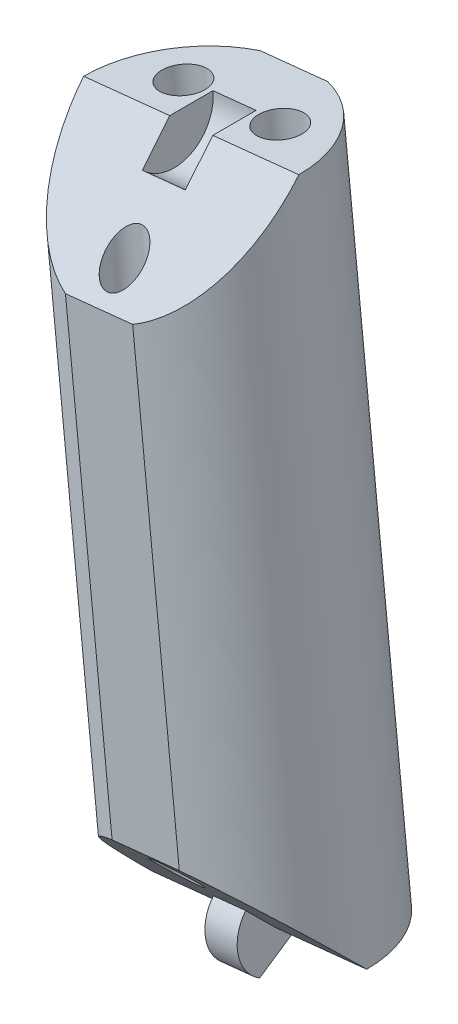
ISO-10303-21;
HEADER;
FILE_DESCRIPTION(('STEP AP214'),'2;1');
FILE_NAME('part.step','',(''),(''),'','','');
FILE_SCHEMA(('AUTOMOTIVE_DESIGN { 1 0 10303 214 1 1 1 1 }'));
ENDSEC;
DATA;
#1=APPLICATION_CONTEXT('core data for automotive mechanical design processes');
#2=APPLICATION_PROTOCOL_DEFINITION('international standard','automotive_design',2000,#1);
#3=PRODUCT_CONTEXT('',#1,'mechanical');
#4=PRODUCT('Part','Part','',(#3));
#5=PRODUCT_RELATED_PRODUCT_CATEGORY('part','',(#4));
#6=PRODUCT_DEFINITION_FORMATION('','',#4);
#7=PRODUCT_DEFINITION_CONTEXT('part definition',#1,'design');
#8=PRODUCT_DEFINITION('design','',#6,#7);
#9=PRODUCT_DEFINITION_SHAPE('','',#8);
#10=(LENGTH_UNIT() NAMED_UNIT(*) SI_UNIT(.MILLI.,.METRE.));
#11=(NAMED_UNIT(*) PLANE_ANGLE_UNIT() SI_UNIT($,.RADIAN.));
#12=(NAMED_UNIT(*) SI_UNIT($,.STERADIAN.) SOLID_ANGLE_UNIT());
#13=UNCERTAINTY_MEASURE_WITH_UNIT(LENGTH_MEASURE(1.E-05),#10,'distance_accuracy_value','');
#14=(GEOMETRIC_REPRESENTATION_CONTEXT(3) GLOBAL_UNCERTAINTY_ASSIGNED_CONTEXT((#13)) GLOBAL_UNIT_ASSIGNED_CONTEXT((#10,
#11,#12)) REPRESENTATION_CONTEXT('',''));
#15=CARTESIAN_POINT('',(0.,0.,0.));
#16=DIRECTION('',(0.,0.,1.));
#17=DIRECTION('',(1.,0.,0.));
#18=AXIS2_PLACEMENT_3D('',#15,#16,#17);
#19=CARTESIAN_POINT('',(-4.95217016442193,148.881060651689,0.));
#20=DIRECTION('',(-0.103150523023817,0.994665757729657,0.));
#21=DIRECTION('',(-0.994665757729657,-0.103150523023817,0.));
#22=AXIS2_PLACEMENT_3D('',#19,#20,#21);
#23=CYLINDRICAL_SURFACE('',#22,8.);
#24=CARTESIAN_POINT('',(-4.95217016442193,148.881060651689,0.));
#25=DIRECTION('',(0.103150523023817,-0.994665757729657,0.));
#26=DIRECTION('',(0.994665757729657,0.103150523023817,0.));
#27=AXIS2_PLACEMENT_3D('',#24,#25,#26);
#28=CIRCLE('',#27,8.);
#29=CARTESIAN_POINT('',(-2.46749589798306,149.138730575616,-7.6));
#30=VERTEX_POINT('',#29);
#31=CARTESIAN_POINT('',(3.00515589741533,149.70626483588,0.));
#32=VERTEX_POINT('',#31);
#33=EDGE_CURVE('E156',#30,#32,#28,.T.);
#34=ORIENTED_EDGE('',*,*,#33,.F.);
#35=DIRECTION('',(-0.103150523023817,0.994665757729657,0.));
#36=VECTOR('',#35,1.);
#37=CARTESIAN_POINT('',(-2.46749589798307,149.138730575616,-7.6));
#38=LINE('',#37,#36);
#39=CARTESIAN_POINT('',(-7.48403157112503,197.512467423771,-7.6));
#40=VERTEX_POINT('',#39);
#41=EDGE_CURVE('E11',#30,#40,#38,.T.);
#42=ORIENTED_EDGE('',*,*,#41,.T.);
#43=CARTESIAN_POINT('',(-9.9687058375639,197.254797499844,0.));
#44=DIRECTION('',(0.103150523023817,-0.994665757729657,0.));
#45=DIRECTION('',(0.994665757729657,0.103150523023817,0.));
#46=AXIS2_PLACEMENT_3D('',#43,#44,#45);
#47=CIRCLE('',#46,8.);
#48=CARTESIAN_POINT('',(-2.01137977572664,198.080001684034,0.));
#49=VERTEX_POINT('',#48);
#50=EDGE_CURVE('E148',#40,#49,#47,.T.);
#51=ORIENTED_EDGE('',*,*,#50,.T.);
#52=CARTESIAN_POINT('',(-9.9687058375639,197.254797499844,0.));
#53=DIRECTION('',(0.0729384343130804,-0.703334902304701,-0.707106781186543));
#54=DIRECTION('',(-0.0729384343130795,0.703334902304692,-0.707106781186552));
#55=AXIS2_PLACEMENT_3D('',#52,#53,#54);
#56=ELLIPSE('',#55,11.3137084989847,8.);
#57=CARTESIAN_POINT('',(-6.70008759614404,189.953007665026,7.6));
#58=VERTEX_POINT('',#57);
#59=EDGE_CURVE('E202',#49,#58,#56,.T.);
#60=ORIENTED_EDGE('',*,*,#59,.T.);
#61=DIRECTION('',(-0.103150523023817,0.994665757729657,0.));
#62=VECTOR('',#61,1.);
#63=CARTESIAN_POINT('',(-2.46749589798307,149.138730575616,7.6));
#64=LINE('',#63,#62);
#65=CARTESIAN_POINT('',(-3.25143987296407,156.698190334362,7.6));
#66=VERTEX_POINT('',#65);
#67=EDGE_CURVE('E174',#58,#66,#64,.F.);
#68=ORIENTED_EDGE('',*,*,#67,.T.);
#69=CARTESIAN_POINT('',(-4.95217016442193,148.881060651689,0.));
#70=DIRECTION('',(-0.0729384343130803,0.703334902304699,-0.707106781186544));
#71=DIRECTION('',(-0.0729384343130797,0.703334902304693,0.707106781186551));
#72=AXIS2_PLACEMENT_3D('',#69,#70,#71);
#73=ELLIPSE('',#72,11.3137084989847,8.);
#74=EDGE_CURVE('E207',#66,#32,#73,.T.);
#75=ORIENTED_EDGE('',*,*,#74,.T.);
#76=EDGE_LOOP('',(#34,#42,#51,#60,#68,#75));
#77=FACE_BOUND('',#76,.T.);
#78=ADVANCED_FACE('F39',(#77),#23,.T.);
#79=CARTESIAN_POINT('',(-9.9687058375639,197.254797499844,0.));
#80=DIRECTION('',(0.103150523023817,-0.994665757729657,0.));
#81=DIRECTION('',(0.994665757729657,0.103150523023817,0.));
#82=AXIS2_PLACEMENT_3D('',#79,#80,#81);
#83=PLANE('',#82);
#84=CARTESIAN_POINT('',(-6.38790910973713,197.62613938273,-3.));
#85=DIRECTION('',(0.103150523023817,-0.994665757729657,0.));
#86=DIRECTION('',(0.994665757729657,0.103150523023817,0.));
#87=AXIS2_PLACEMENT_3D('',#84,#85,#86);
#88=CIRCLE('',#87,1.6);
#89=CARTESIAN_POINT('',(-4.79644389736968,197.791180219568,-3.));
#90=VERTEX_POINT('',#89);
#91=EDGE_CURVE('E189',#90,#90,#88,.T.);
#92=ORIENTED_EDGE('',*,*,#91,.T.);
#93=EDGE_LOOP('',(#92));
#94=FACE_BOUND('',#93,.T.);
#95=CARTESIAN_POINT('',(-13.5495025653907,196.883455616958,-3.));
#96=DIRECTION('',(0.103150523023817,-0.994665757729657,0.));
#97=DIRECTION('',(0.994665757729657,0.103150523023817,0.));
#98=AXIS2_PLACEMENT_3D('',#95,#96,#97);
#99=CIRCLE('',#98,1.6);
#100=CARTESIAN_POINT('',(-11.9580373530232,197.048496453796,-3.));
#101=VERTEX_POINT('',#100);
#102=EDGE_CURVE('E184',#101,#101,#99,.T.);
#103=ORIENTED_EDGE('',*,*,#102,.T.);
#104=EDGE_LOOP('',(#103));
#105=FACE_BOUND('',#104,.T.);
#106=ORIENTED_EDGE('',*,*,#50,.F.);
#107=DIRECTION('',(0.994665757729657,0.103150523023816,0.));
#108=VECTOR('',#107,1.);
#109=CARTESIAN_POINT('',(-12.4533801040028,196.997127575917,-7.6));
#110=LINE('',#109,#108);
#111=CARTESIAN_POINT('',(-12.4533801040028,196.997127575917,-7.6));
#112=VERTEX_POINT('',#111);
#113=EDGE_CURVE('E134',#112,#40,#110,.T.);
#114=ORIENTED_EDGE('',*,*,#113,.F.);
#115=CARTESIAN_POINT('',(-17.9260318994012,196.429593315653,0.));
#116=VERTEX_POINT('',#115);
#117=EDGE_CURVE('E146',#116,#112,#47,.T.);
#118=ORIENTED_EDGE('',*,*,#117,.F.);
#119=DIRECTION('',(0.994665757729657,0.103150523023817,0.));
#120=VECTOR('',#119,1.);
#121=CARTESIAN_POINT('',(-9.9687058375639,197.254797499844,0.));
#122=LINE('',#121,#120);
#123=CARTESIAN_POINT('',(-11.5601710499314,197.089756663006,0.));
#124=VERTEX_POINT('',#123);
#125=EDGE_CURVE('E165',#116,#124,#122,.T.);
#126=ORIENTED_EDGE('',*,*,#125,.T.);
#127=DIRECTION('',(0.,0.,-1.));
#128=VECTOR('',#127,1.);
#129=CARTESIAN_POINT('',(-11.5601710499314,197.089756663006,0.));
#130=LINE('',#129,#128);
#131=CARTESIAN_POINT('',(-11.5601710499314,197.089756663006,-3.2));
#132=VERTEX_POINT('',#131);
#133=EDGE_CURVE('E256',#124,#132,#130,.T.);
#134=ORIENTED_EDGE('',*,*,#133,.T.);
#135=DIRECTION('',(-0.994665757729657,-0.103150523023817,0.));
#136=VECTOR('',#135,1.);
#137=CARTESIAN_POINT('',(-8.37724062519646,197.419838336682,-3.2));
#138=LINE('',#137,#136);
#139=CARTESIAN_POINT('',(-8.37724062519646,197.419838336682,-3.2));
#140=VERTEX_POINT('',#139);
#141=EDGE_CURVE('E269',#140,#132,#138,.T.);
#142=ORIENTED_EDGE('',*,*,#141,.F.);
#143=DIRECTION('',(0.,0.,-1.));
#144=VECTOR('',#143,1.);
#145=CARTESIAN_POINT('',(-8.37724062519647,197.419838336682,0.));
#146=LINE('',#145,#144);
#147=CARTESIAN_POINT('',(-8.37724062519647,197.419838336682,0.));
#148=VERTEX_POINT('',#147);
#149=EDGE_CURVE('E257',#148,#140,#146,.T.);
#150=ORIENTED_EDGE('',*,*,#149,.F.);
#151=EDGE_CURVE('E169',#148,#49,#122,.T.);
#152=ORIENTED_EDGE('',*,*,#151,.T.);
#153=EDGE_LOOP('',(#106,#114,#118,#126,#134,#142,#150,#152));
#154=FACE_BOUND('',#153,.T.);
#155=ADVANCED_FACE('F144',(#94,#105,#154),#83,.F.);
#156=CARTESIAN_POINT('',(2.95177980534998,198.594699714665,0.));
#157=DIRECTION('',(0.0729384343130804,-0.703334902304701,-0.707106781186543));
#158=DIRECTION('',(0.,0.708995228875744,-0.705213276556412));
#159=AXIS2_PLACEMENT_3D('',#156,#157,#158);
#160=PLANE('',#159);
#161=CARTESIAN_POINT('',(-9.40137796093292,191.784135832331,5.5));
#162=DIRECTION('',(0.0729384343130804,-0.703334902304701,-0.707106781186543));
#163=DIRECTION('',(-0.0729384343130795,0.703334902304692,-0.707106781186552));
#164=AXIS2_PLACEMENT_3D('',#161,#162,#163);
#165=ELLIPSE('',#164,1.97989898732232,1.4);
#166=CARTESIAN_POINT('',(-9.54578869316626,193.176667893152,4.1));
#167=VERTEX_POINT('',#166);
#168=EDGE_CURVE('E179',#167,#167,#165,.T.);
#169=ORIENTED_EDGE('',*,*,#168,.T.);
#170=EDGE_LOOP('',(#169));
#171=FACE_BOUND('',#170,.T.);
#172=CARTESIAN_POINT('',(-11.6694361290218,189.437667817172,7.6));
#173=VERTEX_POINT('',#172);
#174=EDGE_CURVE('E153',#173,#116,#56,.T.);
#175=ORIENTED_EDGE('',*,*,#174,.F.);
#176=DIRECTION('',(0.994665757729657,0.103150523023817,0.));
#177=VECTOR('',#176,1.);
#178=CARTESIAN_POINT('',(3.73572378033098,191.035239955919,7.6));
#179=LINE('',#178,#177);
#180=EDGE_CURVE('E198',#173,#58,#179,.T.);
#181=ORIENTED_EDGE('',*,*,#180,.T.);
#182=ORIENTED_EDGE('',*,*,#59,.F.);
#183=ORIENTED_EDGE('',*,*,#151,.F.);
#184=DIRECTION('',(-0.0729384343130776,0.703334902304677,-0.707106781186567));
#185=VECTOR('',#184,1.);
#186=CARTESIAN_POINT('',(-8.14383763539462,195.169166649307,2.26274169979702));
#187=LINE('',#186,#185);
#188=CARTESIAN_POINT('',(-8.14383763539462,195.169166649307,2.26274169979702));
#189=VERTEX_POINT('',#188);
#190=EDGE_CURVE('E266',#189,#148,#187,.T.);
#191=ORIENTED_EDGE('',*,*,#190,.F.);
#192=DIRECTION('',(-0.994665757729657,-0.103150523023817,0.));
#193=VECTOR('',#192,1.);
#194=CARTESIAN_POINT('',(-8.14383763539462,195.169166649307,2.26274169979702));
#195=LINE('',#194,#193);
#196=CARTESIAN_POINT('',(-11.3267680601295,194.839084975631,2.26274169979702));
#197=VERTEX_POINT('',#196);
#198=EDGE_CURVE('E278',#189,#197,#195,.T.);
#199=ORIENTED_EDGE('',*,*,#198,.T.);
#200=DIRECTION('',(-0.0729384343130776,0.703334902304677,-0.707106781186567));
#201=VECTOR('',#200,1.);
#202=CARTESIAN_POINT('',(-11.3267680601295,194.839084975631,2.26274169979702));
#203=LINE('',#202,#201);
#204=EDGE_CURVE('E262',#197,#124,#203,.T.);
#205=ORIENTED_EDGE('',*,*,#204,.T.);
#206=ORIENTED_EDGE('',*,*,#125,.F.);
#207=EDGE_LOOP('',(#175,#181,#182,#183,#191,#199,#205,#206));
#208=FACE_BOUND('',#207,.T.);
#209=ADVANCED_FACE('F196',(#171,#208),#160,.F.);
#210=CARTESIAN_POINT('',(-4.95217016442193,148.881060651689,0.));
#211=DIRECTION('',(0.103150523023817,-0.994665757729657,0.));
#212=DIRECTION('',(0.994665757729657,0.103150523023817,0.));
#213=AXIS2_PLACEMENT_3D('',#210,#211,#212);
#214=PLANE('',#213);
#215=DIRECTION('',(-0.994665757729657,-0.103150523023817,0.));
#216=VECTOR('',#215,1.);
#217=CARTESIAN_POINT('',(-4.95217016442193,148.881060651689,-7.6));
#218=LINE('',#217,#216);
#219=CARTESIAN_POINT('',(-7.43684443086079,148.623390727762,-7.6));
#220=VERTEX_POINT('',#219);
#221=EDGE_CURVE('E55',#30,#220,#218,.T.);
#222=ORIENTED_EDGE('',*,*,#221,.F.);
#223=ORIENTED_EDGE('',*,*,#33,.T.);
#224=DIRECTION('',(0.994665757729657,0.103150523023817,0.));
#225=VECTOR('',#224,1.);
#226=CARTESIAN_POINT('',(-4.95217016442193,148.881060651689,0.));
#227=LINE('',#226,#225);
#228=CARTESIAN_POINT('',(-3.75857125514635,149.004841279318,0.));
#229=VERTEX_POINT('',#228);
#230=EDGE_CURVE('E168',#229,#32,#227,.T.);
#231=ORIENTED_EDGE('',*,*,#230,.F.);
#232=DIRECTION('',(0.,0.,-1.));
#233=VECTOR('',#232,1.);
#234=CARTESIAN_POINT('',(-3.75857125514636,149.004841279318,0.));
#235=LINE('',#234,#233);
#236=CARTESIAN_POINT('',(-3.75857125514636,149.004841279318,-2.8));
#237=VERTEX_POINT('',#236);
#238=EDGE_CURVE('E282',#229,#237,#235,.T.);
#239=ORIENTED_EDGE('',*,*,#238,.T.);
#240=DIRECTION('',(0.994665757729657,0.103150523023817,0.));
#241=VECTOR('',#240,1.);
#242=CARTESIAN_POINT('',(-6.14576907369753,148.757280024061,-2.8));
#243=LINE('',#242,#241);
#244=CARTESIAN_POINT('',(-6.14576907369753,148.757280024061,-2.8));
#245=VERTEX_POINT('',#244);
#246=EDGE_CURVE('E203',#245,#237,#243,.T.);
#247=ORIENTED_EDGE('',*,*,#246,.F.);
#248=DIRECTION('',(0.,0.,-1.));
#249=VECTOR('',#248,1.);
#250=CARTESIAN_POINT('',(-6.14576907369753,148.757280024061,0.));
#251=LINE('',#250,#249);
#252=CARTESIAN_POINT('',(-6.14576907369753,148.757280024061,0.));
#253=VERTEX_POINT('',#252);
#254=EDGE_CURVE('E237',#253,#245,#251,.T.);
#255=ORIENTED_EDGE('',*,*,#254,.F.);
#256=CARTESIAN_POINT('',(-12.9094962262592,148.055856467499,0.));
#257=VERTEX_POINT('',#256);
#258=EDGE_CURVE('E170',#257,#253,#227,.T.);
#259=ORIENTED_EDGE('',*,*,#258,.F.);
#260=EDGE_CURVE('E160',#257,#220,#28,.T.);
#261=ORIENTED_EDGE('',*,*,#260,.T.);
#262=EDGE_LOOP('',(#222,#223,#231,#239,#247,#255,#259,#261));
#263=FACE_BOUND('',#262,.T.);
#264=CARTESIAN_POINT('',(-1.37137343659516,149.252402534575,-3.));
#265=DIRECTION('',(0.103150523023817,-0.994665757729657,0.));
#266=DIRECTION('',(0.994665757729657,0.103150523023817,0.));
#267=AXIS2_PLACEMENT_3D('',#264,#265,#266);
#268=CIRCLE('',#267,1.6);
#269=CARTESIAN_POINT('',(0.220091775772289,149.417443371413,-3.));
#270=VERTEX_POINT('',#269);
#271=EDGE_CURVE('E185',#270,#270,#268,.T.);
#272=ORIENTED_EDGE('',*,*,#271,.F.);
#273=EDGE_LOOP('',(#272));
#274=FACE_BOUND('',#273,.T.);
#275=CARTESIAN_POINT('',(-8.53296689224869,148.509718768804,-3.));
#276=DIRECTION('',(0.103150523023817,-0.994665757729657,0.));
#277=DIRECTION('',(0.994665757729657,0.103150523023817,0.));
#278=AXIS2_PLACEMENT_3D('',#275,#276,#277);
#279=CIRCLE('',#278,1.6);
#280=CARTESIAN_POINT('',(-6.94150167988124,148.674759605642,-3.));
#281=VERTEX_POINT('',#280);
#282=EDGE_CURVE('E180',#281,#281,#279,.T.);
#283=ORIENTED_EDGE('',*,*,#282,.F.);
#284=EDGE_LOOP('',(#283));
#285=FACE_BOUND('',#284,.T.);
#286=ADVANCED_FACE('F232',(#263,#274,#285),#214,.T.);
#287=CARTESIAN_POINT('',(7.96831547849195,150.22096286651,0.));
#288=DIRECTION('',(-0.0729384343130803,0.703334902304699,-0.707106781186544));
#289=DIRECTION('',(0.,0.708995228875745,0.705213276556411));
#290=AXIS2_PLACEMENT_3D('',#287,#288,#289);
#291=PLANE('',#290);
#292=CARTESIAN_POINT('',(-5.51949804105292,154.351722319203,5.5));
#293=DIRECTION('',(-0.0729384343130803,0.703334902304699,-0.707106781186544));
#294=DIRECTION('',(-0.0729384343130797,0.703334902304693,0.707106781186551));
#295=AXIS2_PLACEMENT_3D('',#292,#293,#294);
#296=ELLIPSE('',#295,1.97989898732232,1.4);
#297=CARTESIAN_POINT('',(-5.66390877328626,155.744254380024,6.9));
#298=VERTEX_POINT('',#297);
#299=EDGE_CURVE('E175',#298,#298,#296,.T.);
#300=ORIENTED_EDGE('',*,*,#299,.T.);
#301=EDGE_LOOP('',(#300));
#302=FACE_BOUND('',#301,.T.);
#303=ORIENTED_EDGE('',*,*,#74,.F.);
#304=DIRECTION('',(-0.994665757729657,-0.103150523023817,0.));
#305=VECTOR('',#304,1.);
#306=CARTESIAN_POINT('',(7.18437150351095,157.780422625256,7.6));
#307=LINE('',#306,#305);
#308=CARTESIAN_POINT('',(-8.2207884058418,156.182850486508,7.6));
#309=VERTEX_POINT('',#308);
#310=EDGE_CURVE('E63',#66,#309,#307,.T.);
#311=ORIENTED_EDGE('',*,*,#310,.T.);
#312=EDGE_CURVE('E162',#257,#309,#73,.T.);
#313=ORIENTED_EDGE('',*,*,#312,.F.);
#314=ORIENTED_EDGE('',*,*,#258,.T.);
#315=DIRECTION('',(0.0729384343130803,-0.703334902304701,-0.707106781186543));
#316=VECTOR('',#315,1.);
#317=CARTESIAN_POINT('',(-6.34999668977416,150.726617750514,1.97989898732232));
#318=LINE('',#317,#316);
#319=CARTESIAN_POINT('',(-6.34999668977416,150.726617750514,1.97989898732232));
#320=VERTEX_POINT('',#319);
#321=EDGE_CURVE('E239',#320,#253,#318,.T.);
#322=ORIENTED_EDGE('',*,*,#321,.F.);
#323=DIRECTION('',(0.994665757729657,0.103150523023817,0.));
#324=VECTOR('',#323,1.);
#325=CARTESIAN_POINT('',(-6.34999668977416,150.726617750514,1.97989898732232));
#326=LINE('',#325,#324);
#327=CARTESIAN_POINT('',(-3.96279887122298,150.974179005771,1.97989898732232));
#328=VERTEX_POINT('',#327);
#329=EDGE_CURVE('E295',#320,#328,#326,.T.);
#330=ORIENTED_EDGE('',*,*,#329,.T.);
#331=DIRECTION('',(0.0729384343130803,-0.703334902304701,-0.707106781186543));
#332=VECTOR('',#331,1.);
#333=CARTESIAN_POINT('',(-3.96279887122298,150.974179005771,1.97989898732232));
#334=LINE('',#333,#332);
#335=EDGE_CURVE('E225',#328,#229,#334,.T.);
#336=ORIENTED_EDGE('',*,*,#335,.T.);
#337=ORIENTED_EDGE('',*,*,#230,.T.);
#338=EDGE_LOOP('',(#303,#311,#313,#314,#322,#330,#336,#337));
#339=FACE_BOUND('',#338,.T.);
#340=ADVANCED_FACE('F222',(#302,#339),#291,.F.);
#341=ORIENTED_EDGE('',*,*,#117,.T.);
#342=DIRECTION('',(-0.103150523023817,0.994665757729657,0.));
#343=VECTOR('',#342,1.);
#344=CARTESIAN_POINT('',(-7.43684443086079,148.623390727762,-7.6));
#345=LINE('',#344,#343);
#346=EDGE_CURVE('E48',#112,#220,#345,.F.);
#347=ORIENTED_EDGE('',*,*,#346,.T.);
#348=ORIENTED_EDGE('',*,*,#260,.F.);
#349=ORIENTED_EDGE('',*,*,#312,.T.);
#350=DIRECTION('',(-0.103150523023817,0.994665757729657,0.));
#351=VECTOR('',#350,1.);
#352=CARTESIAN_POINT('',(-7.43684443086079,148.623390727762,7.6));
#353=LINE('',#352,#351);
#354=EDGE_CURVE('E140',#309,#173,#353,.T.);
#355=ORIENTED_EDGE('',*,*,#354,.T.);
#356=ORIENTED_EDGE('',*,*,#174,.T.);
#357=EDGE_LOOP('',(#341,#347,#348,#349,#355,#356));
#358=FACE_BOUND('',#357,.T.);
#359=ADVANCED_FACE('F41',(#358),#23,.T.);
#360=CARTESIAN_POINT('',(-6.14576907369753,148.757280024061,-2.8));
#361=DIRECTION('',(-0.0893309733522772,0.861405814468384,0.499999999999995));
#362=DIRECTION('',(0.,-0.502007025803858,0.864863541862856));
#363=AXIS2_PLACEMENT_3D('',#360,#361,#362);
#364=PLANE('',#363);
#365=DIRECTION('',(0.0515752615119079,-0.497332878864824,0.866025403784442));
#366=VECTOR('',#365,1.);
#367=CARTESIAN_POINT('',(-3.75857125514636,149.004841279318,-2.8));
#368=LINE('',#367,#366);
#369=CARTESIAN_POINT('',(-3.50844452975998,146.592904998807,1.40000000000003));
#370=VERTEX_POINT('',#369);
#371=EDGE_CURVE('E298',#237,#370,#368,.T.);
#372=ORIENTED_EDGE('',*,*,#371,.T.);
#373=DIRECTION('',(0.994665757729657,0.103150523023817,0.));
#374=VECTOR('',#373,1.);
#375=CARTESIAN_POINT('',(-5.89564234831116,146.345343743549,1.40000000000003));
#376=LINE('',#375,#374);
#377=CARTESIAN_POINT('',(-5.89564234831116,146.345343743549,1.40000000000003));
#378=VERTEX_POINT('',#377);
#379=EDGE_CURVE('E209',#378,#370,#376,.T.);
#380=ORIENTED_EDGE('',*,*,#379,.F.);
#381=DIRECTION('',(0.0515752615119079,-0.497332878864824,0.866025403784442));
#382=VECTOR('',#381,1.);
#383=CARTESIAN_POINT('',(-6.14576907369753,148.757280024061,-2.8));
#384=LINE('',#383,#382);
#385=EDGE_CURVE('E287',#245,#378,#384,.T.);
#386=ORIENTED_EDGE('',*,*,#385,.F.);
#387=ORIENTED_EDGE('',*,*,#246,.T.);
#388=EDGE_LOOP('',(#372,#380,#386,#387));
#389=FACE_BOUND('',#388,.T.);
#390=ADVANCED_FACE('F318',(#389),#364,.F.);
#391=CARTESIAN_POINT('',(-6.14576907369753,148.757280024061,0.));
#392=DIRECTION('',(0.994665757729657,0.103150523023817,0.));
#393=DIRECTION('',(-0.103150523023817,0.994665757729657,0.));
#394=AXIS2_PLACEMENT_3D('',#391,#392,#393);
#395=CYLINDRICAL_SURFACE('',#394,2.8);
#396=CARTESIAN_POINT('',(-3.75857125514636,149.004841279318,0.));
#397=DIRECTION('',(-0.994665757729657,-0.103150523023817,0.));
#398=DIRECTION('',(-0.103150523023817,0.994665757729657,0.));
#399=AXIS2_PLACEMENT_3D('',#396,#397,#398);
#400=CIRCLE('',#399,2.8);
#401=EDGE_CURVE('E301',#370,#328,#400,.T.);
#402=ORIENTED_EDGE('',*,*,#401,.T.);
#403=ORIENTED_EDGE('',*,*,#329,.F.);
#404=CARTESIAN_POINT('',(-6.14576907369753,148.757280024061,0.));
#405=DIRECTION('',(-0.994665757729657,-0.103150523023817,0.));
#406=DIRECTION('',(-0.103150523023817,0.994665757729657,0.));
#407=AXIS2_PLACEMENT_3D('',#404,#405,#406);
#408=CIRCLE('',#407,2.8);
#409=EDGE_CURVE('E290',#378,#320,#408,.T.);
#410=ORIENTED_EDGE('',*,*,#409,.F.);
#411=ORIENTED_EDGE('',*,*,#379,.T.);
#412=EDGE_LOOP('',(#402,#403,#410,#411));
#413=FACE_BOUND('',#412,.T.);
#414=ADVANCED_FACE('F313',(#413),#395,.T.);
#415=CARTESIAN_POINT('',(-6.14576907369753,148.757280024061,0.));
#416=DIRECTION('',(0.994665757729657,0.103150523023817,0.));
#417=DIRECTION('',(-0.103150523023817,0.994665757729657,0.));
#418=AXIS2_PLACEMENT_3D('',#415,#416,#417);
#419=PLANE('',#418);
#420=ORIENTED_EDGE('',*,*,#254,.T.);
#421=ORIENTED_EDGE('',*,*,#385,.T.);
#422=ORIENTED_EDGE('',*,*,#409,.T.);
#423=ORIENTED_EDGE('',*,*,#321,.T.);
#424=EDGE_LOOP('',(#420,#421,#422,#423));
#425=FACE_BOUND('',#424,.T.);
#426=ADVANCED_FACE('F320',(#425),#419,.F.);
#427=CARTESIAN_POINT('',(-3.75857125514636,149.004841279318,0.));
#428=DIRECTION('',(0.994665757729657,0.103150523023817,0.));
#429=DIRECTION('',(-0.103150523023817,0.994665757729657,0.));
#430=AXIS2_PLACEMENT_3D('',#427,#428,#429);
#431=PLANE('',#430);
#432=ORIENTED_EDGE('',*,*,#238,.F.);
#433=ORIENTED_EDGE('',*,*,#335,.F.);
#434=ORIENTED_EDGE('',*,*,#401,.F.);
#435=ORIENTED_EDGE('',*,*,#371,.F.);
#436=EDGE_LOOP('',(#432,#433,#434,#435));
#437=FACE_BOUND('',#436,.T.);
#438=ADVANCED_FACE('F317',(#437),#431,.T.);
#439=CARTESIAN_POINT('',(-8.37724062519647,197.419838336682,0.));
#440=DIRECTION('',(-0.994665757729657,-0.103150523023817,0.));
#441=DIRECTION('',(0.103150523023817,-0.994665757729657,0.));
#442=AXIS2_PLACEMENT_3D('',#439,#440,#441);
#443=CYLINDRICAL_SURFACE('',#442,3.2);
#444=CARTESIAN_POINT('',(-11.5601710499314,197.089756663006,0.));
#445=DIRECTION('',(-0.994665757729657,-0.103150523023817,0.));
#446=DIRECTION('',(0.103150523023817,-0.994665757729657,0.));
#447=AXIS2_PLACEMENT_3D('',#444,#445,#446);
#448=CIRCLE('',#447,3.2);
#449=EDGE_CURVE('E273',#132,#197,#448,.T.);
#450=ORIENTED_EDGE('',*,*,#449,.T.);
#451=ORIENTED_EDGE('',*,*,#198,.F.);
#452=CARTESIAN_POINT('',(-8.37724062519647,197.419838336682,0.));
#453=DIRECTION('',(-0.994665757729657,-0.103150523023817,0.));
#454=DIRECTION('',(0.103150523023817,-0.994665757729657,0.));
#455=AXIS2_PLACEMENT_3D('',#452,#453,#454);
#456=CIRCLE('',#455,3.2);
#457=EDGE_CURVE('E261',#140,#189,#456,.T.);
#458=ORIENTED_EDGE('',*,*,#457,.F.);
#459=ORIENTED_EDGE('',*,*,#141,.T.);
#460=EDGE_LOOP('',(#450,#451,#458,#459));
#461=FACE_BOUND('',#460,.T.);
#462=ADVANCED_FACE('F327',(#461),#443,.F.);
#463=CARTESIAN_POINT('',(-8.37724062519647,197.419838336682,0.));
#464=DIRECTION('',(-0.994665757729657,-0.103150523023817,0.));
#465=DIRECTION('',(0.103150523023817,-0.994665757729657,0.));
#466=AXIS2_PLACEMENT_3D('',#463,#464,#465);
#467=PLANE('',#466);
#468=ORIENTED_EDGE('',*,*,#149,.T.);
#469=ORIENTED_EDGE('',*,*,#457,.T.);
#470=ORIENTED_EDGE('',*,*,#190,.T.);
#471=EDGE_LOOP('',(#468,#469,#470));
#472=FACE_BOUND('',#471,.T.);
#473=ADVANCED_FACE('F368',(#472),#467,.T.);
#474=CARTESIAN_POINT('',(-11.5601710499314,197.089756663006,0.));
#475=DIRECTION('',(-0.994665757729657,-0.103150523023817,0.));
#476=DIRECTION('',(0.103150523023817,-0.994665757729657,0.));
#477=AXIS2_PLACEMENT_3D('',#474,#475,#476);
#478=PLANE('',#477);
#479=ORIENTED_EDGE('',*,*,#133,.F.);
#480=ORIENTED_EDGE('',*,*,#204,.F.);
#481=ORIENTED_EDGE('',*,*,#449,.F.);
#482=EDGE_LOOP('',(#479,#480,#481));
#483=FACE_BOUND('',#482,.T.);
#484=ADVANCED_FACE('F358',(#483),#478,.F.);
#485=CARTESIAN_POINT('',(-4.60733867511599,145.555899861954,5.5));
#486=DIRECTION('',(-0.103150523023817,0.994665757729657,0.));
#487=DIRECTION('',(-0.994665757729657,-0.103150523023817,0.));
#488=AXIS2_PLACEMENT_3D('',#485,#486,#487);
#489=CYLINDRICAL_SURFACE('',#488,1.4);
#490=ORIENTED_EDGE('',*,*,#299,.F.);
#491=EDGE_LOOP('',(#490));
#492=FACE_BOUND('',#491,.T.);
#493=ORIENTED_EDGE('',*,*,#168,.F.);
#494=EDGE_LOOP('',(#493));
#495=FACE_BOUND('',#494,.T.);
#496=ADVANCED_FACE('F355',(#492,#495),#489,.F.);
#497=CARTESIAN_POINT('',(-8.18813540294276,145.184557979068,-3.));
#498=DIRECTION('',(-0.103150523023817,0.994665757729657,0.));
#499=DIRECTION('',(-0.994665757729657,-0.103150523023817,0.));
#500=AXIS2_PLACEMENT_3D('',#497,#498,#499);
#501=CYLINDRICAL_SURFACE('',#500,1.6);
#502=ORIENTED_EDGE('',*,*,#282,.T.);
#503=EDGE_LOOP('',(#502));
#504=FACE_BOUND('',#503,.T.);
#505=ORIENTED_EDGE('',*,*,#102,.F.);
#506=EDGE_LOOP('',(#505));
#507=FACE_BOUND('',#506,.T.);
#508=ADVANCED_FACE('F357',(#504,#507),#501,.F.);
#509=CARTESIAN_POINT('',(-1.02654194728922,145.927241744839,-3.));
#510=DIRECTION('',(-0.103150523023817,0.994665757729657,0.));
#511=DIRECTION('',(-0.994665757729657,-0.103150523023817,0.));
#512=AXIS2_PLACEMENT_3D('',#509,#510,#511);
#513=CYLINDRICAL_SURFACE('',#512,1.6);
#514=ORIENTED_EDGE('',*,*,#271,.T.);
#515=EDGE_LOOP('',(#514));
#516=FACE_BOUND('',#515,.T.);
#517=ORIENTED_EDGE('',*,*,#91,.F.);
#518=EDGE_LOOP('',(#517));
#519=FACE_BOUND('',#518,.T.);
#520=ADVANCED_FACE('F365',(#516,#519),#513,.F.);
#521=CARTESIAN_POINT('',(-7.09201294155485,145.298229938027,7.6));
#522=DIRECTION('',(0.,0.,-1.));
#523=DIRECTION('',(-1.,0.,0.));
#524=AXIS2_PLACEMENT_3D('',#521,#522,#523);
#525=PLANE('',#524);
#526=ORIENTED_EDGE('',*,*,#354,.F.);
#527=ORIENTED_EDGE('',*,*,#310,.F.);
#528=ORIENTED_EDGE('',*,*,#67,.F.);
#529=ORIENTED_EDGE('',*,*,#180,.F.);
#530=EDGE_LOOP('',(#526,#527,#528,#529));
#531=FACE_BOUND('',#530,.T.);
#532=ADVANCED_FACE('F374',(#531),#525,.F.);
#533=CARTESIAN_POINT('',(-7.09201294155486,145.298229938027,-7.6));
#534=DIRECTION('',(0.,0.,1.));
#535=DIRECTION('',(1.,0.,0.));
#536=AXIS2_PLACEMENT_3D('',#533,#534,#535);
#537=PLANE('',#536);
#538=ORIENTED_EDGE('',*,*,#221,.T.);
#539=ORIENTED_EDGE('',*,*,#346,.F.);
#540=ORIENTED_EDGE('',*,*,#113,.T.);
#541=ORIENTED_EDGE('',*,*,#41,.F.);
#542=EDGE_LOOP('',(#538,#539,#540,#541));
#543=FACE_BOUND('',#542,.T.);
#544=ADVANCED_FACE('F133',(#543),#537,.F.);
#545=CLOSED_SHELL('',(#78,#155,#209,#286,#340,#359,#390,#414,#426,#438,#462,#473,#484,#496,#508,
#520,#532,#544));
#546=MANIFOLD_SOLID_BREP('B2',#545);
#547=ADVANCED_BREP_SHAPE_REPRESENTATION('',(#18,#546),#14);
#548=SHAPE_DEFINITION_REPRESENTATION(#9,#547);
ENDSEC;
END-ISO-10303-21;
